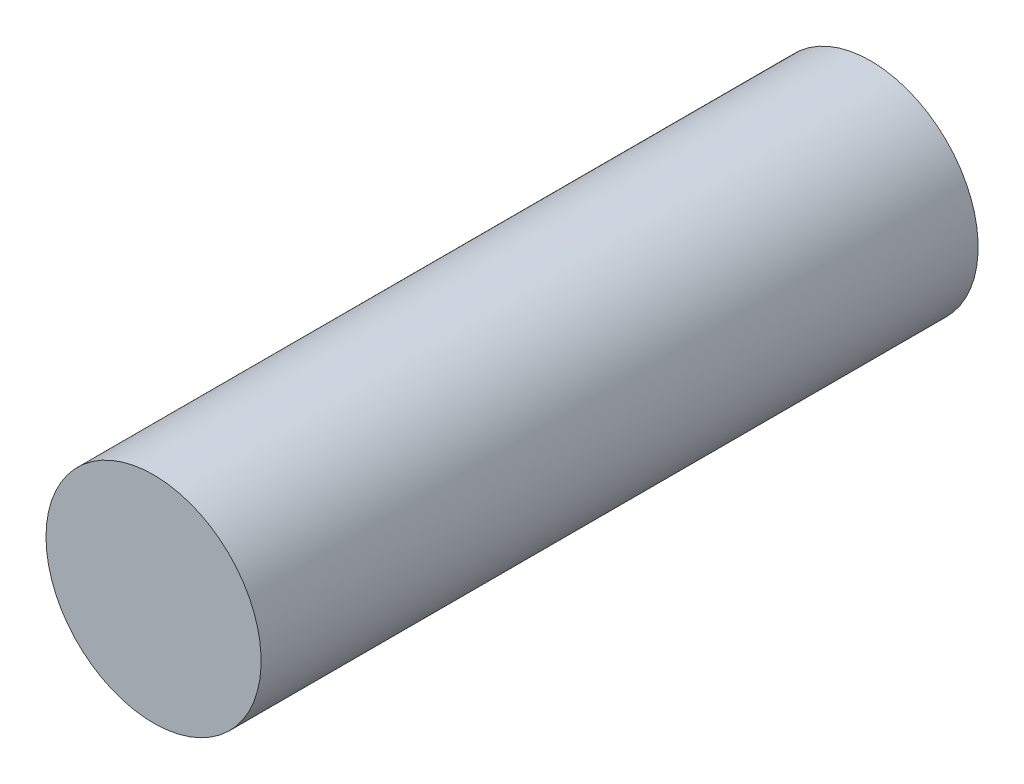
ISO-10303-21;
HEADER;
FILE_DESCRIPTION(('STEP AP214'),'2;1');
FILE_NAME('part.step','',(''),(''),'','','');
FILE_SCHEMA(('AUTOMOTIVE_DESIGN { 1 0 10303 214 1 1 1 1 }'));
ENDSEC;
DATA;
#1=APPLICATION_CONTEXT('core data for automotive mechanical design processes');
#2=APPLICATION_PROTOCOL_DEFINITION('international standard','automotive_design',2000,#1);
#3=PRODUCT_CONTEXT('',#1,'mechanical');
#4=PRODUCT('Part','Part','',(#3));
#5=PRODUCT_RELATED_PRODUCT_CATEGORY('part','',(#4));
#6=PRODUCT_DEFINITION_FORMATION('','',#4);
#7=PRODUCT_DEFINITION_CONTEXT('part definition',#1,'design');
#8=PRODUCT_DEFINITION('design','',#6,#7);
#9=PRODUCT_DEFINITION_SHAPE('','',#8);
#10=(LENGTH_UNIT() NAMED_UNIT(*) SI_UNIT(.MILLI.,.METRE.));
#11=(NAMED_UNIT(*) PLANE_ANGLE_UNIT() SI_UNIT($,.RADIAN.));
#12=(NAMED_UNIT(*) SI_UNIT($,.STERADIAN.) SOLID_ANGLE_UNIT());
#13=UNCERTAINTY_MEASURE_WITH_UNIT(LENGTH_MEASURE(1.E-05),#10,'distance_accuracy_value','');
#14=(GEOMETRIC_REPRESENTATION_CONTEXT(3) GLOBAL_UNCERTAINTY_ASSIGNED_CONTEXT((#13)) GLOBAL_UNIT_ASSIGNED_CONTEXT((#10,
#11,#12)) REPRESENTATION_CONTEXT('',''));
#15=CARTESIAN_POINT('',(0.,0.,0.));
#16=DIRECTION('',(0.,0.,1.));
#17=DIRECTION('',(1.,0.,0.));
#18=AXIS2_PLACEMENT_3D('',#15,#16,#17);
#19=CARTESIAN_POINT('',(0.,0.,-20.));
#20=DIRECTION('',(0.,0.,-1.));
#21=DIRECTION('',(-1.,0.,0.));
#22=AXIS2_PLACEMENT_3D('',#19,#20,#21);
#23=PLANE('',#22);
#24=CARTESIAN_POINT('',(0.,0.,-20.));
#25=DIRECTION('',(0.,0.,-1.));
#26=DIRECTION('',(-1.,0.,0.));
#27=AXIS2_PLACEMENT_3D('',#24,#25,#26);
#28=CIRCLE('',#27,3.);
#29=CARTESIAN_POINT('',(-3.,0.,-20.));
#30=VERTEX_POINT('',#29);
#31=EDGE_CURVE('E18',#30,#30,#28,.F.);
#32=ORIENTED_EDGE('',*,*,#31,.F.);
#33=EDGE_LOOP('',(#32));
#34=FACE_BOUND('',#33,.T.);
#35=ADVANCED_FACE('F15',(#34),#23,.T.);
#36=CARTESIAN_POINT('',(0.,0.,0.));
#37=DIRECTION('',(0.,0.,1.));
#38=DIRECTION('',(1.,0.,0.));
#39=AXIS2_PLACEMENT_3D('',#36,#37,#38);
#40=PLANE('',#39);
#41=CARTESIAN_POINT('',(0.,0.,0.));
#42=DIRECTION('',(0.,0.,-1.));
#43=DIRECTION('',(-1.,0.,0.));
#44=AXIS2_PLACEMENT_3D('',#41,#42,#43);
#45=CIRCLE('',#44,3.);
#46=CARTESIAN_POINT('',(-3.,0.,0.));
#47=VERTEX_POINT('',#46);
#48=EDGE_CURVE('E10',#47,#47,#45,.T.);
#49=ORIENTED_EDGE('',*,*,#48,.F.);
#50=EDGE_LOOP('',(#49));
#51=FACE_BOUND('',#50,.T.);
#52=ADVANCED_FACE('F30',(#51),#40,.T.);
#53=CARTESIAN_POINT('',(0.,0.,0.));
#54=DIRECTION('',(0.,0.,-1.));
#55=DIRECTION('',(-1.,0.,0.));
#56=AXIS2_PLACEMENT_3D('',#53,#54,#55);
#57=CYLINDRICAL_SURFACE('',#56,3.);
#58=ORIENTED_EDGE('',*,*,#48,.T.);
#59=EDGE_LOOP('',(#58));
#60=FACE_BOUND('',#59,.T.);
#61=ORIENTED_EDGE('',*,*,#31,.T.);
#62=EDGE_LOOP('',(#61));
#63=FACE_BOUND('',#62,.T.);
#64=ADVANCED_FACE('F27',(#60,#63),#57,.T.);
#65=CLOSED_SHELL('',(#35,#52,#64));
#66=MANIFOLD_SOLID_BREP('B1',#65);
#67=ADVANCED_BREP_SHAPE_REPRESENTATION('',(#18,#66),#14);
#68=SHAPE_DEFINITION_REPRESENTATION(#9,#67);
ENDSEC;
END-ISO-10303-21;
